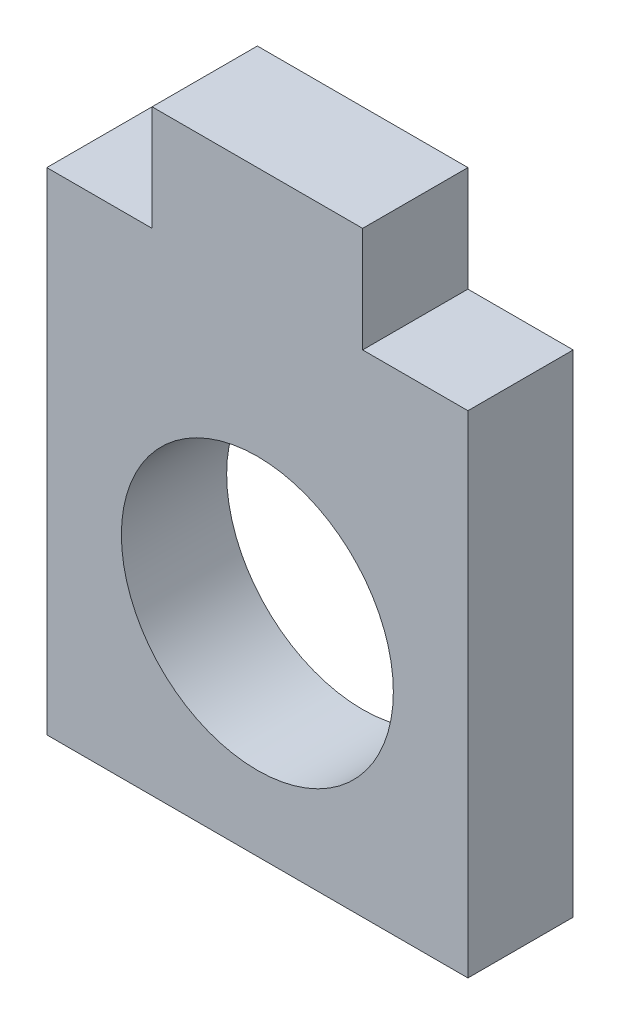
ISO-10303-21;
HEADER;
FILE_DESCRIPTION(('STEP AP214'),'2;1');
FILE_NAME('part.step','',(''),(''),'','','');
FILE_SCHEMA(('AUTOMOTIVE_DESIGN { 1 0 10303 214 1 1 1 1 }'));
ENDSEC;
DATA;
#1=APPLICATION_CONTEXT('core data for automotive mechanical design processes');
#2=APPLICATION_PROTOCOL_DEFINITION('international standard','automotive_design',2000,#1);
#3=PRODUCT_CONTEXT('',#1,'mechanical');
#4=PRODUCT('Part','Part','',(#3));
#5=PRODUCT_RELATED_PRODUCT_CATEGORY('part','',(#4));
#6=PRODUCT_DEFINITION_FORMATION('','',#4);
#7=PRODUCT_DEFINITION_CONTEXT('part definition',#1,'design');
#8=PRODUCT_DEFINITION('design','',#6,#7);
#9=PRODUCT_DEFINITION_SHAPE('','',#8);
#10=(LENGTH_UNIT() NAMED_UNIT(*) SI_UNIT(.MILLI.,.METRE.));
#11=(NAMED_UNIT(*) PLANE_ANGLE_UNIT() SI_UNIT($,.RADIAN.));
#12=(NAMED_UNIT(*) SI_UNIT($,.STERADIAN.) SOLID_ANGLE_UNIT());
#13=UNCERTAINTY_MEASURE_WITH_UNIT(LENGTH_MEASURE(1.E-05),#10,'distance_accuracy_value','');
#14=(GEOMETRIC_REPRESENTATION_CONTEXT(3) GLOBAL_UNCERTAINTY_ASSIGNED_CONTEXT((#13)) GLOBAL_UNIT_ASSIGNED_CONTEXT((#10,
#11,#12)) REPRESENTATION_CONTEXT('',''));
#15=CARTESIAN_POINT('',(0.,0.,0.));
#16=DIRECTION('',(0.,0.,1.));
#17=DIRECTION('',(1.,0.,0.));
#18=AXIS2_PLACEMENT_3D('',#15,#16,#17);
#19=CARTESIAN_POINT('',(-6.,6.,3.));
#20=DIRECTION('',(0.,-1.,0.));
#21=DIRECTION('',(0.,0.,-1.));
#22=AXIS2_PLACEMENT_3D('',#19,#20,#21);
#23=PLANE('',#22);
#24=DIRECTION('',(0.,0.,1.));
#25=VECTOR('',#24,1.);
#26=CARTESIAN_POINT('',(-3.,6.,0.));
#27=LINE('',#26,#25);
#28=CARTESIAN_POINT('',(-3.,6.,0.));
#29=VERTEX_POINT('',#28);
#30=CARTESIAN_POINT('',(-3.,6.,3.));
#31=VERTEX_POINT('',#30);
#32=EDGE_CURVE('E120',#29,#31,#27,.T.);
#33=ORIENTED_EDGE('',*,*,#32,.F.);
#34=DIRECTION('',(-1.,0.,0.));
#35=VECTOR('',#34,1.);
#36=CARTESIAN_POINT('',(-6.,6.,0.));
#37=LINE('',#36,#35);
#38=CARTESIAN_POINT('',(-6.,6.,0.));
#39=VERTEX_POINT('',#38);
#40=EDGE_CURVE('E145',#29,#39,#37,.T.);
#41=ORIENTED_EDGE('',*,*,#40,.T.);
#42=DIRECTION('',(0.,0.,-1.));
#43=VECTOR('',#42,1.);
#44=CARTESIAN_POINT('',(-6.,6.,3.));
#45=LINE('',#44,#43);
#46=CARTESIAN_POINT('',(-6.,6.,3.));
#47=VERTEX_POINT('',#46);
#48=EDGE_CURVE('E41',#47,#39,#45,.T.);
#49=ORIENTED_EDGE('',*,*,#48,.F.);
#50=DIRECTION('',(-1.,0.,0.));
#51=VECTOR('',#50,1.);
#52=CARTESIAN_POINT('',(-6.,6.,3.));
#53=LINE('',#52,#51);
#54=EDGE_CURVE('E48',#31,#47,#53,.T.);
#55=ORIENTED_EDGE('',*,*,#54,.F.);
#56=EDGE_LOOP('',(#33,#41,#49,#55));
#57=FACE_BOUND('',#56,.T.);
#58=ADVANCED_FACE('F33',(#57),#23,.F.);
#59=DIRECTION('',(0.,0.,-1.));
#60=VECTOR('',#59,1.);
#61=CARTESIAN_POINT('',(3.,6.,0.));
#62=LINE('',#61,#60);
#63=CARTESIAN_POINT('',(3.,6.,3.));
#64=VERTEX_POINT('',#63);
#65=CARTESIAN_POINT('',(3.,6.,0.));
#66=VERTEX_POINT('',#65);
#67=EDGE_CURVE('E56',#64,#66,#62,.T.);
#68=ORIENTED_EDGE('',*,*,#67,.F.);
#69=CARTESIAN_POINT('',(6.,6.,3.));
#70=VERTEX_POINT('',#69);
#71=EDGE_CURVE('E136',#70,#64,#53,.T.);
#72=ORIENTED_EDGE('',*,*,#71,.F.);
#73=DIRECTION('',(0.,0.,-1.));
#74=VECTOR('',#73,1.);
#75=CARTESIAN_POINT('',(6.,6.,3.));
#76=LINE('',#75,#74);
#77=CARTESIAN_POINT('',(6.,6.,0.));
#78=VERTEX_POINT('',#77);
#79=EDGE_CURVE('E11',#70,#78,#76,.T.);
#80=ORIENTED_EDGE('',*,*,#79,.T.);
#81=EDGE_CURVE('E146',#78,#66,#37,.T.);
#82=ORIENTED_EDGE('',*,*,#81,.T.);
#83=EDGE_LOOP('',(#68,#72,#80,#82));
#84=FACE_BOUND('',#83,.T.);
#85=ADVANCED_FACE('F183',(#84),#23,.F.);
#86=CARTESIAN_POINT('',(6.,6.,3.));
#87=DIRECTION('',(-1.,0.,0.));
#88=DIRECTION('',(0.,-1.,0.));
#89=AXIS2_PLACEMENT_3D('',#86,#87,#88);
#90=PLANE('',#89);
#91=DIRECTION('',(0.,1.,0.));
#92=VECTOR('',#91,1.);
#93=CARTESIAN_POINT('',(6.,6.,0.));
#94=LINE('',#93,#92);
#95=CARTESIAN_POINT('',(6.,-8.,0.));
#96=VERTEX_POINT('',#95);
#97=EDGE_CURVE('E131',#96,#78,#94,.T.);
#98=ORIENTED_EDGE('',*,*,#97,.T.);
#99=ORIENTED_EDGE('',*,*,#79,.F.);
#100=DIRECTION('',(0.,1.,0.));
#101=VECTOR('',#100,1.);
#102=CARTESIAN_POINT('',(6.,6.,3.));
#103=LINE('',#102,#101);
#104=CARTESIAN_POINT('',(6.,-8.,3.));
#105=VERTEX_POINT('',#104);
#106=EDGE_CURVE('E133',#105,#70,#103,.T.);
#107=ORIENTED_EDGE('',*,*,#106,.F.);
#108=DIRECTION('',(0.,0.,-1.));
#109=VECTOR('',#108,1.);
#110=CARTESIAN_POINT('',(6.,-8.,3.));
#111=LINE('',#110,#109);
#112=EDGE_CURVE('E142',#105,#96,#111,.T.);
#113=ORIENTED_EDGE('',*,*,#112,.T.);
#114=EDGE_LOOP('',(#98,#99,#107,#113));
#115=FACE_BOUND('',#114,.T.);
#116=ADVANCED_FACE('F35',(#115),#90,.F.);
#117=CARTESIAN_POINT('',(-6.,6.,3.));
#118=DIRECTION('',(1.,0.,0.));
#119=DIRECTION('',(0.,1.,0.));
#120=AXIS2_PLACEMENT_3D('',#117,#118,#119);
#121=PLANE('',#120);
#122=DIRECTION('',(0.,-1.,0.));
#123=VECTOR('',#122,1.);
#124=CARTESIAN_POINT('',(-6.,6.,0.));
#125=LINE('',#124,#123);
#126=CARTESIAN_POINT('',(-6.,-8.,0.));
#127=VERTEX_POINT('',#126);
#128=EDGE_CURVE('E148',#39,#127,#125,.T.);
#129=ORIENTED_EDGE('',*,*,#128,.T.);
#130=DIRECTION('',(0.,0.,-1.));
#131=VECTOR('',#130,1.);
#132=CARTESIAN_POINT('',(-6.,-8.,3.));
#133=LINE('',#132,#131);
#134=CARTESIAN_POINT('',(-6.,-8.,3.));
#135=VERTEX_POINT('',#134);
#136=EDGE_CURVE('E153',#135,#127,#133,.T.);
#137=ORIENTED_EDGE('',*,*,#136,.F.);
#138=DIRECTION('',(0.,-1.,0.));
#139=VECTOR('',#138,1.);
#140=CARTESIAN_POINT('',(-6.,6.,3.));
#141=LINE('',#140,#139);
#142=EDGE_CURVE('E138',#47,#135,#141,.T.);
#143=ORIENTED_EDGE('',*,*,#142,.F.);
#144=ORIENTED_EDGE('',*,*,#48,.T.);
#145=EDGE_LOOP('',(#129,#137,#143,#144));
#146=FACE_BOUND('',#145,.T.);
#147=ADVANCED_FACE('F159',(#146),#121,.F.);
#148=CARTESIAN_POINT('',(-6.,-8.,3.));
#149=DIRECTION('',(0.,1.,0.));
#150=DIRECTION('',(0.,0.,1.));
#151=AXIS2_PLACEMENT_3D('',#148,#149,#150);
#152=PLANE('',#151);
#153=DIRECTION('',(1.,0.,0.));
#154=VECTOR('',#153,1.);
#155=CARTESIAN_POINT('',(-6.,-8.,0.));
#156=LINE('',#155,#154);
#157=EDGE_CURVE('E135',#127,#96,#156,.T.);
#158=ORIENTED_EDGE('',*,*,#157,.T.);
#159=ORIENTED_EDGE('',*,*,#112,.F.);
#160=DIRECTION('',(1.,0.,0.));
#161=VECTOR('',#160,1.);
#162=CARTESIAN_POINT('',(-6.,-8.,3.));
#163=LINE('',#162,#161);
#164=EDGE_CURVE('E140',#135,#105,#163,.T.);
#165=ORIENTED_EDGE('',*,*,#164,.F.);
#166=ORIENTED_EDGE('',*,*,#136,.T.);
#167=EDGE_LOOP('',(#158,#159,#165,#166));
#168=FACE_BOUND('',#167,.T.);
#169=ADVANCED_FACE('F168',(#168),#152,.F.);
#170=CARTESIAN_POINT('',(0.,0.,3.));
#171=DIRECTION('',(0.,0.,1.));
#172=DIRECTION('',(1.,0.,0.));
#173=AXIS2_PLACEMENT_3D('',#170,#171,#172);
#174=PLANE('',#173);
#175=CARTESIAN_POINT('',(0.,-2.,3.));
#176=DIRECTION('',(0.,0.,1.));
#177=DIRECTION('',(1.,0.,0.));
#178=AXIS2_PLACEMENT_3D('',#175,#176,#177);
#179=CIRCLE('',#178,3.875);
#180=CARTESIAN_POINT('',(3.875,-2.,3.));
#181=VERTEX_POINT('',#180);
#182=EDGE_CURVE('E121',#181,#181,#179,.T.);
#183=ORIENTED_EDGE('',*,*,#182,.F.);
#184=EDGE_LOOP('',(#183));
#185=FACE_BOUND('',#184,.T.);
#186=ORIENTED_EDGE('',*,*,#106,.T.);
#187=ORIENTED_EDGE('',*,*,#71,.T.);
#188=DIRECTION('',(0.,-1.,0.));
#189=VECTOR('',#188,1.);
#190=CARTESIAN_POINT('',(3.,9.,3.));
#191=LINE('',#190,#189);
#192=CARTESIAN_POINT('',(3.,9.,3.));
#193=VERTEX_POINT('',#192);
#194=EDGE_CURVE('E105',#193,#64,#191,.T.);
#195=ORIENTED_EDGE('',*,*,#194,.F.);
#196=DIRECTION('',(1.,0.,0.));
#197=VECTOR('',#196,1.);
#198=CARTESIAN_POINT('',(-3.,9.,3.));
#199=LINE('',#198,#197);
#200=CARTESIAN_POINT('',(-3.,9.,3.));
#201=VERTEX_POINT('',#200);
#202=EDGE_CURVE('E97',#201,#193,#199,.T.);
#203=ORIENTED_EDGE('',*,*,#202,.F.);
#204=DIRECTION('',(0.,-1.,0.));
#205=VECTOR('',#204,1.);
#206=CARTESIAN_POINT('',(-3.,9.,3.));
#207=LINE('',#206,#205);
#208=EDGE_CURVE('E102',#201,#31,#207,.T.);
#209=ORIENTED_EDGE('',*,*,#208,.T.);
#210=ORIENTED_EDGE('',*,*,#54,.T.);
#211=ORIENTED_EDGE('',*,*,#142,.T.);
#212=ORIENTED_EDGE('',*,*,#164,.T.);
#213=EDGE_LOOP('',(#186,#187,#195,#203,#209,#210,#211,#212));
#214=FACE_BOUND('',#213,.T.);
#215=ADVANCED_FACE('F100',(#185,#214),#174,.T.);
#216=CARTESIAN_POINT('',(0.,0.,0.));
#217=DIRECTION('',(0.,0.,1.));
#218=DIRECTION('',(1.,0.,0.));
#219=AXIS2_PLACEMENT_3D('',#216,#217,#218);
#220=PLANE('',#219);
#221=CARTESIAN_POINT('',(0.,-2.,0.));
#222=DIRECTION('',(0.,0.,1.));
#223=DIRECTION('',(1.,0.,0.));
#224=AXIS2_PLACEMENT_3D('',#221,#222,#223);
#225=CIRCLE('',#224,3.875);
#226=CARTESIAN_POINT('',(3.875,-2.,0.));
#227=VERTEX_POINT('',#226);
#228=EDGE_CURVE('E124',#227,#227,#225,.T.);
#229=ORIENTED_EDGE('',*,*,#228,.T.);
#230=EDGE_LOOP('',(#229));
#231=FACE_BOUND('',#230,.T.);
#232=ORIENTED_EDGE('',*,*,#97,.F.);
#233=ORIENTED_EDGE('',*,*,#157,.F.);
#234=ORIENTED_EDGE('',*,*,#128,.F.);
#235=ORIENTED_EDGE('',*,*,#40,.F.);
#236=DIRECTION('',(0.,-1.,0.));
#237=VECTOR('',#236,1.);
#238=CARTESIAN_POINT('',(-3.,9.,0.));
#239=LINE('',#238,#237);
#240=CARTESIAN_POINT('',(-3.,9.,0.));
#241=VERTEX_POINT('',#240);
#242=EDGE_CURVE('E178',#241,#29,#239,.T.);
#243=ORIENTED_EDGE('',*,*,#242,.F.);
#244=DIRECTION('',(-1.,0.,0.));
#245=VECTOR('',#244,1.);
#246=CARTESIAN_POINT('',(-3.,9.,0.));
#247=LINE('',#246,#245);
#248=CARTESIAN_POINT('',(3.,9.,0.));
#249=VERTEX_POINT('',#248);
#250=EDGE_CURVE('E114',#249,#241,#247,.T.);
#251=ORIENTED_EDGE('',*,*,#250,.F.);
#252=DIRECTION('',(0.,-1.,0.));
#253=VECTOR('',#252,1.);
#254=CARTESIAN_POINT('',(3.,9.,0.));
#255=LINE('',#254,#253);
#256=EDGE_CURVE('E126',#249,#66,#255,.T.);
#257=ORIENTED_EDGE('',*,*,#256,.T.);
#258=ORIENTED_EDGE('',*,*,#81,.F.);
#259=EDGE_LOOP('',(#232,#233,#234,#235,#243,#251,#257,#258));
#260=FACE_BOUND('',#259,.T.);
#261=ADVANCED_FACE('F165',(#231,#260),#220,.F.);
#262=CARTESIAN_POINT('',(0.,-2.,0.));
#263=DIRECTION('',(0.,0.,1.));
#264=DIRECTION('',(1.,0.,0.));
#265=AXIS2_PLACEMENT_3D('',#262,#263,#264);
#266=CYLINDRICAL_SURFACE('',#265,3.875);
#267=ORIENTED_EDGE('',*,*,#228,.F.);
#268=EDGE_LOOP('',(#267));
#269=FACE_BOUND('',#268,.T.);
#270=ORIENTED_EDGE('',*,*,#182,.T.);
#271=EDGE_LOOP('',(#270));
#272=FACE_BOUND('',#271,.T.);
#273=ADVANCED_FACE('F196',(#269,#272),#266,.F.);
#274=CARTESIAN_POINT('',(-3.,9.,0.));
#275=DIRECTION('',(1.,0.,0.));
#276=DIRECTION('',(0.,0.,-1.));
#277=AXIS2_PLACEMENT_3D('',#274,#275,#276);
#278=PLANE('',#277);
#279=ORIENTED_EDGE('',*,*,#32,.T.);
#280=ORIENTED_EDGE('',*,*,#208,.F.);
#281=DIRECTION('',(0.,0.,1.));
#282=VECTOR('',#281,1.);
#283=CARTESIAN_POINT('',(-3.,9.,0.));
#284=LINE('',#283,#282);
#285=EDGE_CURVE('E109',#241,#201,#284,.T.);
#286=ORIENTED_EDGE('',*,*,#285,.F.);
#287=ORIENTED_EDGE('',*,*,#242,.T.);
#288=EDGE_LOOP('',(#279,#280,#286,#287));
#289=FACE_BOUND('',#288,.T.);
#290=ADVANCED_FACE('F119',(#289),#278,.F.);
#291=CARTESIAN_POINT('',(3.,9.,0.));
#292=DIRECTION('',(-1.,0.,0.));
#293=DIRECTION('',(0.,0.,1.));
#294=AXIS2_PLACEMENT_3D('',#291,#292,#293);
#295=PLANE('',#294);
#296=ORIENTED_EDGE('',*,*,#67,.T.);
#297=ORIENTED_EDGE('',*,*,#256,.F.);
#298=DIRECTION('',(0.,0.,-1.));
#299=VECTOR('',#298,1.);
#300=CARTESIAN_POINT('',(3.,9.,0.));
#301=LINE('',#300,#299);
#302=EDGE_CURVE('E108',#193,#249,#301,.T.);
#303=ORIENTED_EDGE('',*,*,#302,.F.);
#304=ORIENTED_EDGE('',*,*,#194,.T.);
#305=EDGE_LOOP('',(#296,#297,#303,#304));
#306=FACE_BOUND('',#305,.T.);
#307=ADVANCED_FACE('F174',(#306),#295,.F.);
#308=CARTESIAN_POINT('',(0.,9.,0.));
#309=DIRECTION('',(0.,1.,0.));
#310=DIRECTION('',(0.,0.,1.));
#311=AXIS2_PLACEMENT_3D('',#308,#309,#310);
#312=PLANE('',#311);
#313=ORIENTED_EDGE('',*,*,#285,.T.);
#314=ORIENTED_EDGE('',*,*,#202,.T.);
#315=ORIENTED_EDGE('',*,*,#302,.T.);
#316=ORIENTED_EDGE('',*,*,#250,.T.);
#317=EDGE_LOOP('',(#313,#314,#315,#316));
#318=FACE_BOUND('',#317,.T.);
#319=ADVANCED_FACE('F112',(#318),#312,.T.);
#320=CLOSED_SHELL('',(#58,#85,#116,#147,#169,#215,#261,#273,#290,#307,#319));
#321=MANIFOLD_SOLID_BREP('B2',#320);
#322=ADVANCED_BREP_SHAPE_REPRESENTATION('',(#18,#321),#14);
#323=SHAPE_DEFINITION_REPRESENTATION(#9,#322);
ENDSEC;
END-ISO-10303-21;
